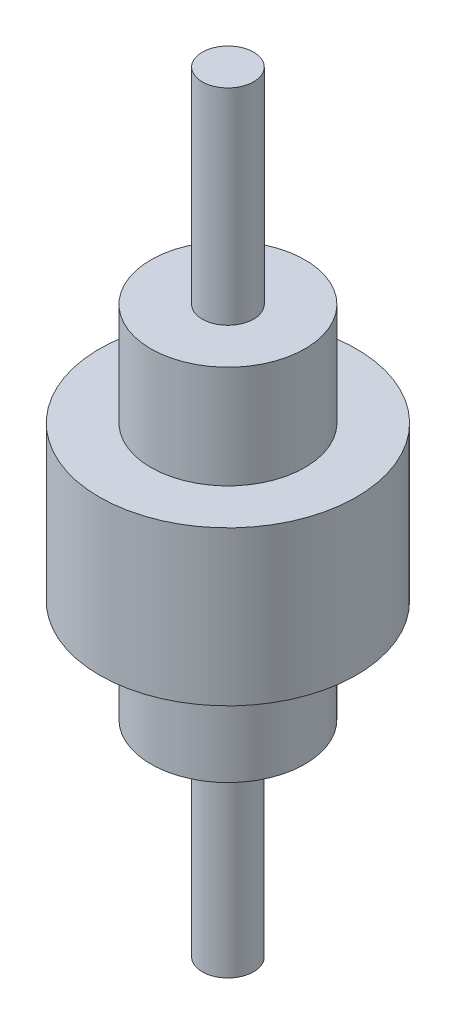
ISO-10303-21;
HEADER;
FILE_DESCRIPTION(('STEP AP214'),'2;1');
FILE_NAME('part.step','',(''),(''),'','','');
FILE_SCHEMA(('AUTOMOTIVE_DESIGN { 1 0 10303 214 1 1 1 1 }'));
ENDSEC;
DATA;
#1=APPLICATION_CONTEXT('core data for automotive mechanical design processes');
#2=APPLICATION_PROTOCOL_DEFINITION('international standard','automotive_design',2000,#1);
#3=PRODUCT_CONTEXT('',#1,'mechanical');
#4=PRODUCT('Part','Part','',(#3));
#5=PRODUCT_RELATED_PRODUCT_CATEGORY('part','',(#4));
#6=PRODUCT_DEFINITION_FORMATION('','',#4);
#7=PRODUCT_DEFINITION_CONTEXT('part definition',#1,'design');
#8=PRODUCT_DEFINITION('design','',#6,#7);
#9=PRODUCT_DEFINITION_SHAPE('','',#8);
#10=(LENGTH_UNIT() NAMED_UNIT(*) SI_UNIT(.MILLI.,.METRE.));
#11=(NAMED_UNIT(*) PLANE_ANGLE_UNIT() SI_UNIT($,.RADIAN.));
#12=(NAMED_UNIT(*) SI_UNIT($,.STERADIAN.) SOLID_ANGLE_UNIT());
#13=UNCERTAINTY_MEASURE_WITH_UNIT(LENGTH_MEASURE(1.E-05),#10,'distance_accuracy_value','');
#14=(GEOMETRIC_REPRESENTATION_CONTEXT(3) GLOBAL_UNCERTAINTY_ASSIGNED_CONTEXT((#13)) GLOBAL_UNIT_ASSIGNED_CONTEXT((#10,
#11,#12)) REPRESENTATION_CONTEXT('',''));
#15=CARTESIAN_POINT('',(0.,0.,0.));
#16=DIRECTION('',(0.,0.,1.));
#17=DIRECTION('',(1.,0.,0.));
#18=AXIS2_PLACEMENT_3D('',#15,#16,#17);
#19=CARTESIAN_POINT('',(0.,60.,0.));
#20=DIRECTION('',(0.,-1.,0.));
#21=DIRECTION('',(0.,0.,-1.));
#22=AXIS2_PLACEMENT_3D('',#19,#20,#21);
#23=CYLINDRICAL_SURFACE('',#22,50.);
#24=CARTESIAN_POINT('',(0.,60.,0.));
#25=DIRECTION('',(0.,1.,0.));
#26=DIRECTION('',(0.,0.,1.));
#27=AXIS2_PLACEMENT_3D('',#24,#25,#26);
#28=CIRCLE('',#27,50.);
#29=CARTESIAN_POINT('',(0.,60.,50.));
#30=VERTEX_POINT('',#29);
#31=EDGE_CURVE('E78',#30,#30,#28,.T.);
#32=ORIENTED_EDGE('',*,*,#31,.F.);
#33=EDGE_LOOP('',(#32));
#34=FACE_BOUND('',#33,.T.);
#35=CARTESIAN_POINT('',(0.,0.,0.));
#36=DIRECTION('',(0.,1.,0.));
#37=DIRECTION('',(0.,0.,1.));
#38=AXIS2_PLACEMENT_3D('',#35,#36,#37);
#39=CIRCLE('',#38,50.);
#40=CARTESIAN_POINT('',(0.,0.,50.));
#41=VERTEX_POINT('',#40);
#42=EDGE_CURVE('E44',#41,#41,#39,.T.);
#43=ORIENTED_EDGE('',*,*,#42,.T.);
#44=EDGE_LOOP('',(#43));
#45=FACE_BOUND('',#44,.T.);
#46=ADVANCED_FACE('F41',(#34,#45),#23,.T.);
#47=CARTESIAN_POINT('',(0.,60.,0.));
#48=DIRECTION('',(0.,1.,0.));
#49=DIRECTION('',(0.,0.,1.));
#50=AXIS2_PLACEMENT_3D('',#47,#48,#49);
#51=PLANE('',#50);
#52=CARTESIAN_POINT('',(0.,60.,0.));
#53=DIRECTION('',(0.,1.,0.));
#54=DIRECTION('',(0.,0.,1.));
#55=AXIS2_PLACEMENT_3D('',#52,#53,#54);
#56=CIRCLE('',#55,30.);
#57=CARTESIAN_POINT('',(0.,60.,30.));
#58=VERTEX_POINT('',#57);
#59=EDGE_CURVE('E72',#58,#58,#56,.T.);
#60=ORIENTED_EDGE('',*,*,#59,.F.);
#61=EDGE_LOOP('',(#60));
#62=FACE_BOUND('',#61,.T.);
#63=ORIENTED_EDGE('',*,*,#31,.T.);
#64=EDGE_LOOP('',(#63));
#65=FACE_BOUND('',#64,.T.);
#66=ADVANCED_FACE('F91',(#62,#65),#51,.T.);
#67=CARTESIAN_POINT('',(0.,0.,0.));
#68=DIRECTION('',(0.,1.,0.));
#69=DIRECTION('',(0.,0.,1.));
#70=AXIS2_PLACEMENT_3D('',#67,#68,#69);
#71=PLANE('',#70);
#72=CARTESIAN_POINT('',(0.,0.,0.));
#73=DIRECTION('',(0.,-1.,0.));
#74=DIRECTION('',(0.,0.,-1.));
#75=AXIS2_PLACEMENT_3D('',#72,#73,#74);
#76=CIRCLE('',#75,30.);
#77=CARTESIAN_POINT('',(0.,0.,-30.));
#78=VERTEX_POINT('',#77);
#79=EDGE_CURVE('E49',#78,#78,#76,.T.);
#80=ORIENTED_EDGE('',*,*,#79,.F.);
#81=EDGE_LOOP('',(#80));
#82=FACE_BOUND('',#81,.T.);
#83=ORIENTED_EDGE('',*,*,#42,.F.);
#84=EDGE_LOOP('',(#83));
#85=FACE_BOUND('',#84,.T.);
#86=ADVANCED_FACE('F88',(#82,#85),#71,.F.);
#87=CARTESIAN_POINT('',(0.,100.,0.));
#88=DIRECTION('',(0.,-1.,0.));
#89=DIRECTION('',(0.,0.,-1.));
#90=AXIS2_PLACEMENT_3D('',#87,#88,#89);
#91=CYLINDRICAL_SURFACE('',#90,30.);
#92=CARTESIAN_POINT('',(0.,100.,0.));
#93=DIRECTION('',(0.,1.,0.));
#94=DIRECTION('',(0.,0.,1.));
#95=AXIS2_PLACEMENT_3D('',#92,#93,#94);
#96=CIRCLE('',#95,30.);
#97=CARTESIAN_POINT('',(0.,100.,30.));
#98=VERTEX_POINT('',#97);
#99=EDGE_CURVE('E68',#98,#98,#96,.T.);
#100=ORIENTED_EDGE('',*,*,#99,.F.);
#101=EDGE_LOOP('',(#100));
#102=FACE_BOUND('',#101,.T.);
#103=ORIENTED_EDGE('',*,*,#59,.T.);
#104=EDGE_LOOP('',(#103));
#105=FACE_BOUND('',#104,.T.);
#106=ADVANCED_FACE('F90',(#102,#105),#91,.T.);
#107=CARTESIAN_POINT('',(0.,100.,0.));
#108=DIRECTION('',(0.,1.,0.));
#109=DIRECTION('',(0.,0.,1.));
#110=AXIS2_PLACEMENT_3D('',#107,#108,#109);
#111=PLANE('',#110);
#112=CARTESIAN_POINT('',(0.,100.,0.));
#113=DIRECTION('',(0.,1.,0.));
#114=DIRECTION('',(0.,0.,1.));
#115=AXIS2_PLACEMENT_3D('',#112,#113,#114);
#116=CIRCLE('',#115,10.);
#117=CARTESIAN_POINT('',(0.,100.,10.));
#118=VERTEX_POINT('',#117);
#119=EDGE_CURVE('E55',#118,#118,#116,.T.);
#120=ORIENTED_EDGE('',*,*,#119,.F.);
#121=EDGE_LOOP('',(#120));
#122=FACE_BOUND('',#121,.T.);
#123=ORIENTED_EDGE('',*,*,#99,.T.);
#124=EDGE_LOOP('',(#123));
#125=FACE_BOUND('',#124,.T.);
#126=ADVANCED_FACE('F97',(#122,#125),#111,.T.);
#127=CARTESIAN_POINT('',(0.,180.,0.));
#128=DIRECTION('',(0.,-1.,0.));
#129=DIRECTION('',(0.,0.,-1.));
#130=AXIS2_PLACEMENT_3D('',#127,#128,#129);
#131=CYLINDRICAL_SURFACE('',#130,10.);
#132=CARTESIAN_POINT('',(0.,180.,0.));
#133=DIRECTION('',(0.,1.,0.));
#134=DIRECTION('',(0.,0.,1.));
#135=AXIS2_PLACEMENT_3D('',#132,#133,#134);
#136=CIRCLE('',#135,10.);
#137=CARTESIAN_POINT('',(0.,180.,10.));
#138=VERTEX_POINT('',#137);
#139=EDGE_CURVE('E63',#138,#138,#136,.T.);
#140=ORIENTED_EDGE('',*,*,#139,.F.);
#141=EDGE_LOOP('',(#140));
#142=FACE_BOUND('',#141,.T.);
#143=ORIENTED_EDGE('',*,*,#119,.T.);
#144=EDGE_LOOP('',(#143));
#145=FACE_BOUND('',#144,.T.);
#146=ADVANCED_FACE('F129',(#142,#145),#131,.T.);
#147=CARTESIAN_POINT('',(0.,180.,0.));
#148=DIRECTION('',(0.,1.,0.));
#149=DIRECTION('',(0.,0.,1.));
#150=AXIS2_PLACEMENT_3D('',#147,#148,#149);
#151=PLANE('',#150);
#152=ORIENTED_EDGE('',*,*,#139,.T.);
#153=EDGE_LOOP('',(#152));
#154=FACE_BOUND('',#153,.T.);
#155=ADVANCED_FACE('F140',(#154),#151,.T.);
#156=CARTESIAN_POINT('',(0.,-39.9999999999999,0.));
#157=DIRECTION('',(0.,1.,0.));
#158=DIRECTION('',(0.,0.,1.));
#159=AXIS2_PLACEMENT_3D('',#156,#157,#158);
#160=CYLINDRICAL_SURFACE('',#159,30.);
#161=CARTESIAN_POINT('',(0.,-39.9999999999999,0.));
#162=DIRECTION('',(0.,-1.,0.));
#163=DIRECTION('',(0.,0.,-1.));
#164=AXIS2_PLACEMENT_3D('',#161,#162,#163);
#165=CIRCLE('',#164,30.);
#166=CARTESIAN_POINT('',(0.,-39.9999999999999,-30.));
#167=VERTEX_POINT('',#166);
#168=EDGE_CURVE('E60',#167,#167,#165,.T.);
#169=ORIENTED_EDGE('',*,*,#168,.F.);
#170=EDGE_LOOP('',(#169));
#171=FACE_BOUND('',#170,.T.);
#172=ORIENTED_EDGE('',*,*,#79,.T.);
#173=EDGE_LOOP('',(#172));
#174=FACE_BOUND('',#173,.T.);
#175=ADVANCED_FACE('F150',(#171,#174),#160,.T.);
#176=CARTESIAN_POINT('',(0.,-39.9999999999999,0.));
#177=DIRECTION('',(0.,-1.,0.));
#178=DIRECTION('',(0.,0.,-1.));
#179=AXIS2_PLACEMENT_3D('',#176,#177,#178);
#180=PLANE('',#179);
#181=CARTESIAN_POINT('',(0.,-39.9999999999999,0.));
#182=DIRECTION('',(0.,-1.,0.));
#183=DIRECTION('',(0.,0.,-1.));
#184=AXIS2_PLACEMENT_3D('',#181,#182,#183);
#185=CIRCLE('',#184,10.);
#186=CARTESIAN_POINT('',(0.,-39.9999999999999,-10.));
#187=VERTEX_POINT('',#186);
#188=EDGE_CURVE('E10',#187,#187,#185,.T.);
#189=ORIENTED_EDGE('',*,*,#188,.F.);
#190=EDGE_LOOP('',(#189));
#191=FACE_BOUND('',#190,.T.);
#192=ORIENTED_EDGE('',*,*,#168,.T.);
#193=EDGE_LOOP('',(#192));
#194=FACE_BOUND('',#193,.T.);
#195=ADVANCED_FACE('F166',(#191,#194),#180,.T.);
#196=CARTESIAN_POINT('',(0.,-120.,0.));
#197=DIRECTION('',(0.,1.,0.));
#198=DIRECTION('',(0.,0.,1.));
#199=AXIS2_PLACEMENT_3D('',#196,#197,#198);
#200=CYLINDRICAL_SURFACE('',#199,10.);
#201=CARTESIAN_POINT('',(0.,-120.,0.));
#202=DIRECTION('',(0.,-1.,0.));
#203=DIRECTION('',(0.,0.,-1.));
#204=AXIS2_PLACEMENT_3D('',#201,#202,#203);
#205=CIRCLE('',#204,10.);
#206=CARTESIAN_POINT('',(0.,-120.,-10.));
#207=VERTEX_POINT('',#206);
#208=EDGE_CURVE('E59',#207,#207,#205,.T.);
#209=ORIENTED_EDGE('',*,*,#208,.F.);
#210=EDGE_LOOP('',(#209));
#211=FACE_BOUND('',#210,.T.);
#212=ORIENTED_EDGE('',*,*,#188,.T.);
#213=EDGE_LOOP('',(#212));
#214=FACE_BOUND('',#213,.T.);
#215=ADVANCED_FACE('F177',(#211,#214),#200,.T.);
#216=CARTESIAN_POINT('',(0.,-120.,0.));
#217=DIRECTION('',(0.,-1.,0.));
#218=DIRECTION('',(0.,0.,-1.));
#219=AXIS2_PLACEMENT_3D('',#216,#217,#218);
#220=PLANE('',#219);
#221=ORIENTED_EDGE('',*,*,#208,.T.);
#222=EDGE_LOOP('',(#221));
#223=FACE_BOUND('',#222,.T.);
#224=ADVANCED_FACE('F188',(#223),#220,.T.);
#225=CLOSED_SHELL('',(#46,#66,#86,#106,#126,#146,#155,#175,#195,#215,#224));
#226=MANIFOLD_SOLID_BREP('B2',#225);
#227=ADVANCED_BREP_SHAPE_REPRESENTATION('',(#18,#226),#14);
#228=SHAPE_DEFINITION_REPRESENTATION(#9,#227);
ENDSEC;
END-ISO-10303-21;
